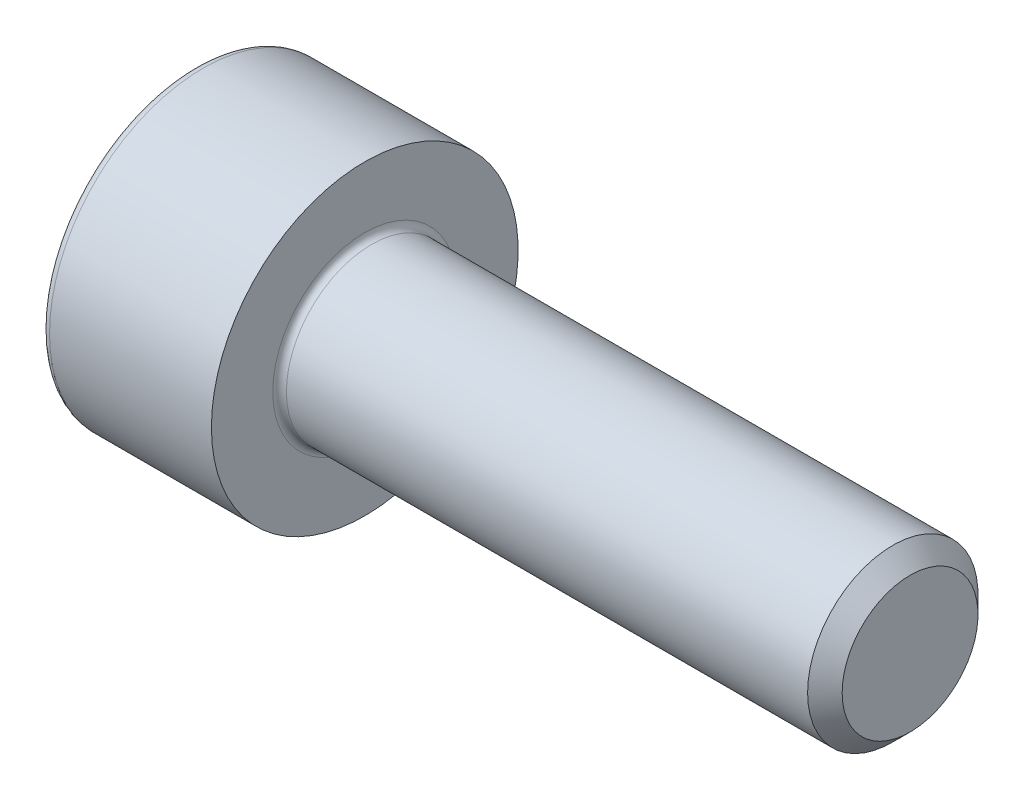
ISO-10303-21;
HEADER;
FILE_DESCRIPTION(('STEP AP214'),'2;1');
FILE_NAME('part.step','',(''),(''),'','','');
FILE_SCHEMA(('AUTOMOTIVE_DESIGN { 1 0 10303 214 1 1 1 1 }'));
ENDSEC;
DATA;
#1=APPLICATION_CONTEXT('core data for automotive mechanical design processes');
#2=APPLICATION_PROTOCOL_DEFINITION('international standard','automotive_design',2000,#1);
#3=PRODUCT_CONTEXT('',#1,'mechanical');
#4=PRODUCT('Part','Part','',(#3));
#5=PRODUCT_RELATED_PRODUCT_CATEGORY('part','',(#4));
#6=PRODUCT_DEFINITION_FORMATION('','',#4);
#7=PRODUCT_DEFINITION_CONTEXT('part definition',#1,'design');
#8=PRODUCT_DEFINITION('design','',#6,#7);
#9=PRODUCT_DEFINITION_SHAPE('','',#8);
#10=(LENGTH_UNIT() NAMED_UNIT(*) SI_UNIT(.MILLI.,.METRE.));
#11=(NAMED_UNIT(*) PLANE_ANGLE_UNIT() SI_UNIT($,.RADIAN.));
#12=(NAMED_UNIT(*) SI_UNIT($,.STERADIAN.) SOLID_ANGLE_UNIT());
#13=UNCERTAINTY_MEASURE_WITH_UNIT(LENGTH_MEASURE(1.E-05),#10,'distance_accuracy_value','');
#14=(GEOMETRIC_REPRESENTATION_CONTEXT(3) GLOBAL_UNCERTAINTY_ASSIGNED_CONTEXT((#13)) GLOBAL_UNIT_ASSIGNED_CONTEXT((#10,
#11,#12)) REPRESENTATION_CONTEXT('',''));
#15=CARTESIAN_POINT('',(0.,0.,0.));
#16=DIRECTION('',(0.,0.,1.));
#17=DIRECTION('',(1.,0.,0.));
#18=AXIS2_PLACEMENT_3D('',#15,#16,#17);
#19=CARTESIAN_POINT('',(0.,0.,0.));
#20=DIRECTION('',(-1.,0.,0.));
#21=DIRECTION('',(0.,0.,1.));
#22=AXIS2_PLACEMENT_3D('',#19,#20,#21);
#23=PLANE('',#22);
#24=DIRECTION('',(0.,-0.499999999999999,0.866025403784439));
#25=VECTOR('',#24,1.);
#26=CARTESIAN_POINT('',(0.,1.18068130049278,0.));
#27=LINE('',#26,#25);
#28=CARTESIAN_POINT('',(0.,1.18068130049278,0.));
#29=VERTEX_POINT('',#28);
#30=CARTESIAN_POINT('',(0.,0.59034065024639,1.0225));
#31=VERTEX_POINT('',#30);
#32=EDGE_CURVE('E261',#29,#31,#27,.T.);
#33=ORIENTED_EDGE('',*,*,#32,.T.);
#34=DIRECTION('',(0.,1.,0.));
#35=VECTOR('',#34,1.);
#36=CARTESIAN_POINT('',(0.,-0.590340650246394,1.0225));
#37=LINE('',#36,#35);
#38=CARTESIAN_POINT('',(0.,-0.590340650246394,1.0225));
#39=VERTEX_POINT('',#38);
#40=EDGE_CURVE('E133',#39,#31,#37,.T.);
#41=ORIENTED_EDGE('',*,*,#40,.F.);
#42=DIRECTION('',(0.,-0.500000000000001,-0.866025403784438));
#43=VECTOR('',#42,1.);
#44=CARTESIAN_POINT('',(0.,-0.590340650246394,1.0225));
#45=LINE('',#44,#43);
#46=CARTESIAN_POINT('',(0.,-1.18068130049279,0.));
#47=VERTEX_POINT('',#46);
#48=EDGE_CURVE('E264',#39,#47,#45,.T.);
#49=ORIENTED_EDGE('',*,*,#48,.T.);
#50=DIRECTION('',(0.,0.499999999999999,-0.86602540378444));
#51=VECTOR('',#50,1.);
#52=CARTESIAN_POINT('',(0.,-1.18068130049279,0.));
#53=LINE('',#52,#51);
#54=CARTESIAN_POINT('',(0.,-0.590340650246397,-1.0225));
#55=VERTEX_POINT('',#54);
#56=EDGE_CURVE('E267',#47,#55,#53,.T.);
#57=ORIENTED_EDGE('',*,*,#56,.T.);
#58=DIRECTION('',(0.,-1.,0.));
#59=VECTOR('',#58,1.);
#60=CARTESIAN_POINT('',(0.,0.590340650246388,-1.0225));
#61=LINE('',#60,#59);
#62=CARTESIAN_POINT('',(0.,0.590340650246388,-1.0225));
#63=VERTEX_POINT('',#62);
#64=EDGE_CURVE('E270',#63,#55,#61,.T.);
#65=ORIENTED_EDGE('',*,*,#64,.F.);
#66=DIRECTION('',(0.,-0.500000000000001,-0.866025403784438));
#67=VECTOR('',#66,1.);
#68=CARTESIAN_POINT('',(0.,1.18068130049278,0.));
#69=LINE('',#68,#67);
#70=EDGE_CURVE('E128',#29,#63,#69,.T.);
#71=ORIENTED_EDGE('',*,*,#70,.F.);
#72=EDGE_LOOP('',(#33,#41,#49,#57,#65,#71));
#73=FACE_BOUND('',#72,.T.);
#74=CARTESIAN_POINT('',(0.,0.,0.));
#75=DIRECTION('',(-1.,0.,0.));
#76=DIRECTION('',(0.,0.,1.));
#77=AXIS2_PLACEMENT_3D('',#74,#75,#76);
#78=CIRCLE('',#77,2.125);
#79=CARTESIAN_POINT('',(0.,0.,2.125));
#80=VERTEX_POINT('',#79);
#81=EDGE_CURVE('E45',#80,#80,#78,.T.);
#82=ORIENTED_EDGE('',*,*,#81,.T.);
#83=EDGE_LOOP('',(#82));
#84=FACE_BOUND('',#83,.T.);
#85=ADVANCED_FACE('F37',(#73,#84),#23,.T.);
#86=CARTESIAN_POINT('',(-31.75,0.,0.));
#87=DIRECTION('',(-1.,0.,0.));
#88=DIRECTION('',(0.,0.,1.));
#89=AXIS2_PLACEMENT_3D('',#86,#87,#88);
#90=CYLINDRICAL_SURFACE('',#89,2.25);
#91=CARTESIAN_POINT('',(0.125,0.,0.));
#92=DIRECTION('',(-1.,0.,0.));
#93=DIRECTION('',(0.,0.,1.));
#94=AXIS2_PLACEMENT_3D('',#91,#92,#93);
#95=CIRCLE('',#94,2.25);
#96=CARTESIAN_POINT('',(0.125,0.,2.25));
#97=VERTEX_POINT('',#96);
#98=EDGE_CURVE('E11',#97,#97,#95,.F.);
#99=ORIENTED_EDGE('',*,*,#98,.T.);
#100=EDGE_LOOP('',(#99));
#101=FACE_BOUND('',#100,.T.);
#102=CARTESIAN_POINT('',(2.5,0.,0.));
#103=DIRECTION('',(-1.,0.,0.));
#104=DIRECTION('',(0.,0.,1.));
#105=AXIS2_PLACEMENT_3D('',#102,#103,#104);
#106=CIRCLE('',#105,2.25);
#107=CARTESIAN_POINT('',(2.5,0.,2.25));
#108=VERTEX_POINT('',#107);
#109=EDGE_CURVE('E151',#108,#108,#106,.T.);
#110=ORIENTED_EDGE('',*,*,#109,.T.);
#111=EDGE_LOOP('',(#110));
#112=FACE_BOUND('',#111,.T.);
#113=ADVANCED_FACE('F175',(#101,#112),#90,.T.);
#114=CARTESIAN_POINT('',(2.5,2.25,0.));
#115=DIRECTION('',(1.,0.,0.));
#116=DIRECTION('',(0.,0.,-1.));
#117=AXIS2_PLACEMENT_3D('',#114,#115,#116);
#118=PLANE('',#117);
#119=CARTESIAN_POINT('',(2.5,0.,0.));
#120=DIRECTION('',(1.,0.,0.));
#121=DIRECTION('',(0.,0.,-1.));
#122=AXIS2_PLACEMENT_3D('',#119,#120,#121);
#123=CIRCLE('',#122,1.35);
#124=CARTESIAN_POINT('',(2.5,0.,-1.35));
#125=VERTEX_POINT('',#124);
#126=EDGE_CURVE('E154',#125,#125,#123,.F.);
#127=ORIENTED_EDGE('',*,*,#126,.T.);
#128=EDGE_LOOP('',(#127));
#129=FACE_BOUND('',#128,.T.);
#130=ORIENTED_EDGE('',*,*,#109,.F.);
#131=EDGE_LOOP('',(#130));
#132=FACE_BOUND('',#131,.T.);
#133=ADVANCED_FACE('F181',(#129,#132),#118,.T.);
#134=CARTESIAN_POINT('',(-31.75,0.,0.));
#135=DIRECTION('',(-1.,0.,0.));
#136=DIRECTION('',(0.,0.,1.));
#137=AXIS2_PLACEMENT_3D('',#134,#135,#136);
#138=CYLINDRICAL_SURFACE('',#137,1.25);
#139=CARTESIAN_POINT('',(2.6,0.,0.));
#140=DIRECTION('',(1.,0.,0.));
#141=DIRECTION('',(0.,0.,-1.));
#142=AXIS2_PLACEMENT_3D('',#139,#140,#141);
#143=CIRCLE('',#142,1.25);
#144=CARTESIAN_POINT('',(2.6,0.,-1.25));
#145=VERTEX_POINT('',#144);
#146=EDGE_CURVE('E157',#145,#145,#143,.T.);
#147=ORIENTED_EDGE('',*,*,#146,.T.);
#148=EDGE_LOOP('',(#147));
#149=FACE_BOUND('',#148,.T.);
#150=CARTESIAN_POINT('',(10.2465,0.,0.));
#151=DIRECTION('',(-1.,0.,0.));
#152=DIRECTION('',(0.,0.,1.));
#153=AXIS2_PLACEMENT_3D('',#150,#151,#152);
#154=CIRCLE('',#153,1.24999999999999);
#155=CARTESIAN_POINT('',(10.2465,0.,1.24999999999999));
#156=VERTEX_POINT('',#155);
#157=EDGE_CURVE('E148',#156,#156,#154,.T.);
#158=ORIENTED_EDGE('',*,*,#157,.T.);
#159=EDGE_LOOP('',(#158));
#160=FACE_BOUND('',#159,.T.);
#161=ADVANCED_FACE('F187',(#149,#160),#138,.T.);
#162=CARTESIAN_POINT('',(10.5,0.,0.));
#163=DIRECTION('',(-1.,0.,0.));
#164=DIRECTION('',(0.,0.,1.));
#165=AXIS2_PLACEMENT_3D('',#162,#163,#164);
#166=CONICAL_SURFACE('',#165,0.9965,0.785398163397419);
#167=ORIENTED_EDGE('',*,*,#157,.F.);
#168=EDGE_LOOP('',(#167));
#169=FACE_BOUND('',#168,.T.);
#170=CARTESIAN_POINT('',(10.5,0.,0.));
#171=DIRECTION('',(-1.,0.,0.));
#172=DIRECTION('',(0.,0.,1.));
#173=AXIS2_PLACEMENT_3D('',#170,#171,#172);
#174=CIRCLE('',#173,0.9965);
#175=CARTESIAN_POINT('',(10.5,0.,0.9965));
#176=VERTEX_POINT('',#175);
#177=EDGE_CURVE('E144',#176,#176,#174,.T.);
#178=ORIENTED_EDGE('',*,*,#177,.T.);
#179=EDGE_LOOP('',(#178));
#180=FACE_BOUND('',#179,.T.);
#181=ADVANCED_FACE('F191',(#169,#180),#166,.T.);
#182=CARTESIAN_POINT('',(10.5,0.9965,0.));
#183=DIRECTION('',(1.,0.,0.));
#184=DIRECTION('',(0.,0.,-1.));
#185=AXIS2_PLACEMENT_3D('',#182,#183,#184);
#186=PLANE('',#185);
#187=ORIENTED_EDGE('',*,*,#177,.F.);
#188=EDGE_LOOP('',(#187));
#189=FACE_BOUND('',#188,.T.);
#190=ADVANCED_FACE('F171',(#189),#186,.T.);
#191=CARTESIAN_POINT('',(2.6,0.,0.));
#192=DIRECTION('',(1.,0.,0.));
#193=DIRECTION('',(0.,0.,-1.));
#194=AXIS2_PLACEMENT_3D('',#191,#192,#193);
#195=TOROIDAL_SURFACE('',#194,1.35,0.1);
#196=ORIENTED_EDGE('',*,*,#146,.F.);
#197=EDGE_LOOP('',(#196));
#198=FACE_BOUND('',#197,.T.);
#199=ORIENTED_EDGE('',*,*,#126,.F.);
#200=EDGE_LOOP('',(#199));
#201=FACE_BOUND('',#200,.T.);
#202=ADVANCED_FACE('F164',(#198,#201),#195,.F.);
#203=CARTESIAN_POINT('',(0.125,0.,0.));
#204=DIRECTION('',(-1.,0.,0.));
#205=DIRECTION('',(0.,0.,1.));
#206=AXIS2_PLACEMENT_3D('',#203,#204,#205);
#207=TOROIDAL_SURFACE('',#206,2.125,0.125);
#208=ORIENTED_EDGE('',*,*,#98,.F.);
#209=EDGE_LOOP('',(#208));
#210=FACE_BOUND('',#209,.T.);
#211=ORIENTED_EDGE('',*,*,#81,.F.);
#212=EDGE_LOOP('',(#211));
#213=FACE_BOUND('',#212,.T.);
#214=ADVANCED_FACE('F39',(#210,#213),#207,.T.);
#215=CARTESIAN_POINT('',(1.1,1.18068130049278,0.));
#216=DIRECTION('',(0.,-0.866025403784439,-0.5));
#217=DIRECTION('',(0.,0.5,-0.866025403784439));
#218=AXIS2_PLACEMENT_3D('',#215,#216,#217);
#219=PLANE('',#218);
#220=ORIENTED_EDGE('',*,*,#32,.F.);
#221=DIRECTION('',(-1.,0.,0.));
#222=VECTOR('',#221,1.);
#223=CARTESIAN_POINT('',(1.1,1.18068130049278,0.));
#224=LINE('',#223,#222);
#225=CARTESIAN_POINT('',(1.1,1.18068130049278,0.));
#226=VERTEX_POINT('',#225);
#227=EDGE_CURVE('E251',#226,#29,#224,.T.);
#228=ORIENTED_EDGE('',*,*,#227,.F.);
#229=DIRECTION('',(0.,-0.499999999999999,0.866025403784439));
#230=VECTOR('',#229,1.);
#231=CARTESIAN_POINT('',(1.1,1.18068130049278,0.));
#232=LINE('',#231,#230);
#233=CARTESIAN_POINT('',(1.1,0.885510975369585,0.511249999999997));
#234=VERTEX_POINT('',#233);
#235=EDGE_CURVE('E120',#226,#234,#232,.T.);
#236=ORIENTED_EDGE('',*,*,#235,.T.);
#237=CARTESIAN_POINT('',(1.1,0.59034065024639,1.0225));
#238=VERTEX_POINT('',#237);
#239=EDGE_CURVE('E111',#234,#238,#232,.T.);
#240=ORIENTED_EDGE('',*,*,#239,.T.);
#241=DIRECTION('',(-1.,0.,0.));
#242=VECTOR('',#241,1.);
#243=CARTESIAN_POINT('',(1.1,0.59034065024639,1.0225));
#244=LINE('',#243,#242);
#245=EDGE_CURVE('E125',#238,#31,#244,.T.);
#246=ORIENTED_EDGE('',*,*,#245,.T.);
#247=EDGE_LOOP('',(#220,#228,#236,#240,#246));
#248=FACE_BOUND('',#247,.T.);
#249=ADVANCED_FACE('F124',(#248),#219,.T.);
#250=CARTESIAN_POINT('',(1.1,-0.590340650246394,1.0225));
#251=DIRECTION('',(0.,0.,1.));
#252=DIRECTION('',(0.,-1.,0.));
#253=AXIS2_PLACEMENT_3D('',#250,#251,#252);
#254=PLANE('',#253);
#255=ORIENTED_EDGE('',*,*,#40,.T.);
#256=ORIENTED_EDGE('',*,*,#245,.F.);
#257=DIRECTION('',(0.,1.,0.));
#258=VECTOR('',#257,1.);
#259=CARTESIAN_POINT('',(1.1,-0.590340650246394,1.0225));
#260=LINE('',#259,#258);
#261=CARTESIAN_POINT('',(1.1,0.,1.0225));
#262=VERTEX_POINT('',#261);
#263=EDGE_CURVE('E108',#262,#238,#260,.T.);
#264=ORIENTED_EDGE('',*,*,#263,.F.);
#265=CARTESIAN_POINT('',(1.1,-0.590340650246394,1.0225));
#266=VERTEX_POINT('',#265);
#267=EDGE_CURVE('E119',#266,#262,#260,.T.);
#268=ORIENTED_EDGE('',*,*,#267,.F.);
#269=DIRECTION('',(-1.,0.,0.));
#270=VECTOR('',#269,1.);
#271=CARTESIAN_POINT('',(1.1,-0.590340650246394,1.0225));
#272=LINE('',#271,#270);
#273=EDGE_CURVE('E135',#266,#39,#272,.T.);
#274=ORIENTED_EDGE('',*,*,#273,.T.);
#275=EDGE_LOOP('',(#255,#256,#264,#268,#274));
#276=FACE_BOUND('',#275,.T.);
#277=ADVANCED_FACE('F130',(#276),#254,.F.);
#278=CARTESIAN_POINT('',(1.1,-0.590340650246394,1.0225));
#279=DIRECTION('',(0.,0.866025403784438,-0.500000000000001));
#280=DIRECTION('',(0.,0.500000000000001,0.866025403784438));
#281=AXIS2_PLACEMENT_3D('',#278,#279,#280);
#282=PLANE('',#281);
#283=ORIENTED_EDGE('',*,*,#48,.F.);
#284=ORIENTED_EDGE('',*,*,#273,.F.);
#285=DIRECTION('',(0.,-0.500000000000001,-0.866025403784438));
#286=VECTOR('',#285,1.);
#287=CARTESIAN_POINT('',(1.1,-0.590340650246394,1.0225));
#288=LINE('',#287,#286);
#289=CARTESIAN_POINT('',(1.1,-0.885510975369589,0.511250000000002));
#290=VERTEX_POINT('',#289);
#291=EDGE_CURVE('E290',#266,#290,#288,.T.);
#292=ORIENTED_EDGE('',*,*,#291,.T.);
#293=CARTESIAN_POINT('',(1.1,-1.18068130049279,0.));
#294=VERTEX_POINT('',#293);
#295=EDGE_CURVE('E279',#290,#294,#288,.T.);
#296=ORIENTED_EDGE('',*,*,#295,.T.);
#297=DIRECTION('',(-1.,0.,0.));
#298=VECTOR('',#297,1.);
#299=CARTESIAN_POINT('',(1.1,-1.18068130049279,0.));
#300=LINE('',#299,#298);
#301=EDGE_CURVE('E140',#294,#47,#300,.T.);
#302=ORIENTED_EDGE('',*,*,#301,.T.);
#303=EDGE_LOOP('',(#283,#284,#292,#296,#302));
#304=FACE_BOUND('',#303,.T.);
#305=ADVANCED_FACE('F205',(#304),#282,.T.);
#306=CARTESIAN_POINT('',(1.1,-1.18068130049279,0.));
#307=DIRECTION('',(0.,0.86602540378444,0.499999999999998));
#308=DIRECTION('',(0.,-0.499999999999998,0.86602540378444));
#309=AXIS2_PLACEMENT_3D('',#306,#307,#308);
#310=PLANE('',#309);
#311=ORIENTED_EDGE('',*,*,#56,.F.);
#312=ORIENTED_EDGE('',*,*,#301,.F.);
#313=DIRECTION('',(0.,0.499999999999999,-0.86602540378444));
#314=VECTOR('',#313,1.);
#315=CARTESIAN_POINT('',(1.1,-1.18068130049279,0.));
#316=LINE('',#315,#314);
#317=CARTESIAN_POINT('',(1.1,-0.885510975369594,-0.511250000000001));
#318=VERTEX_POINT('',#317);
#319=EDGE_CURVE('E257',#294,#318,#316,.T.);
#320=ORIENTED_EDGE('',*,*,#319,.T.);
#321=CARTESIAN_POINT('',(1.1,-0.590340650246397,-1.0225));
#322=VERTEX_POINT('',#321);
#323=EDGE_CURVE('E289',#318,#322,#316,.T.);
#324=ORIENTED_EDGE('',*,*,#323,.T.);
#325=DIRECTION('',(-1.,0.,0.));
#326=VECTOR('',#325,1.);
#327=CARTESIAN_POINT('',(1.1,-0.590340650246397,-1.0225));
#328=LINE('',#327,#326);
#329=EDGE_CURVE('E250',#322,#55,#328,.T.);
#330=ORIENTED_EDGE('',*,*,#329,.T.);
#331=EDGE_LOOP('',(#311,#312,#320,#324,#330));
#332=FACE_BOUND('',#331,.T.);
#333=ADVANCED_FACE('F208',(#332),#310,.T.);
#334=CARTESIAN_POINT('',(1.1,0.590340650246388,-1.0225));
#335=DIRECTION('',(0.,0.,-1.));
#336=DIRECTION('',(0.,1.,0.));
#337=AXIS2_PLACEMENT_3D('',#334,#335,#336);
#338=PLANE('',#337);
#339=ORIENTED_EDGE('',*,*,#64,.T.);
#340=ORIENTED_EDGE('',*,*,#329,.F.);
#341=DIRECTION('',(0.,-1.,0.));
#342=VECTOR('',#341,1.);
#343=CARTESIAN_POINT('',(1.1,0.590340650246388,-1.0225));
#344=LINE('',#343,#342);
#345=CARTESIAN_POINT('',(1.1,0.,-1.0225));
#346=VERTEX_POINT('',#345);
#347=EDGE_CURVE('E254',#346,#322,#344,.T.);
#348=ORIENTED_EDGE('',*,*,#347,.F.);
#349=CARTESIAN_POINT('',(1.1,0.590340650246388,-1.0225));
#350=VERTEX_POINT('',#349);
#351=EDGE_CURVE('E52',#350,#346,#344,.T.);
#352=ORIENTED_EDGE('',*,*,#351,.F.);
#353=DIRECTION('',(-1.,0.,0.));
#354=VECTOR('',#353,1.);
#355=CARTESIAN_POINT('',(1.1,0.590340650246388,-1.0225));
#356=LINE('',#355,#354);
#357=EDGE_CURVE('E247',#350,#63,#356,.T.);
#358=ORIENTED_EDGE('',*,*,#357,.T.);
#359=EDGE_LOOP('',(#339,#340,#348,#352,#358));
#360=FACE_BOUND('',#359,.T.);
#361=ADVANCED_FACE('F212',(#360),#338,.F.);
#362=CARTESIAN_POINT('',(1.1,1.18068130049278,0.));
#363=DIRECTION('',(0.,0.866025403784438,-0.500000000000001));
#364=DIRECTION('',(0.,0.500000000000001,0.866025403784438));
#365=AXIS2_PLACEMENT_3D('',#362,#363,#364);
#366=PLANE('',#365);
#367=ORIENTED_EDGE('',*,*,#70,.T.);
#368=ORIENTED_EDGE('',*,*,#357,.F.);
#369=DIRECTION('',(0.,-0.500000000000001,-0.866025403784438));
#370=VECTOR('',#369,1.);
#371=CARTESIAN_POINT('',(1.1,1.18068130049278,0.));
#372=LINE('',#371,#370);
#373=CARTESIAN_POINT('',(1.1,0.885510975369587,-0.511250000000001));
#374=VERTEX_POINT('',#373);
#375=EDGE_CURVE('E237',#374,#350,#372,.T.);
#376=ORIENTED_EDGE('',*,*,#375,.F.);
#377=EDGE_CURVE('E243',#226,#374,#372,.T.);
#378=ORIENTED_EDGE('',*,*,#377,.F.);
#379=ORIENTED_EDGE('',*,*,#227,.T.);
#380=EDGE_LOOP('',(#367,#368,#376,#378,#379));
#381=FACE_BOUND('',#380,.T.);
#382=ADVANCED_FACE('F216',(#381),#366,.F.);
#383=CARTESIAN_POINT('',(1.1,0.,2.045));
#384=DIRECTION('',(1.,0.,0.));
#385=DIRECTION('',(0.,0.,-1.));
#386=AXIS2_PLACEMENT_3D('',#383,#384,#385);
#387=PLANE('',#386);
#388=ORIENTED_EDGE('',*,*,#347,.T.);
#389=ORIENTED_EDGE('',*,*,#323,.F.);
#390=CARTESIAN_POINT('',(1.1,0.,0.));
#391=DIRECTION('',(-1.,0.,0.));
#392=DIRECTION('',(0.,0.,1.));
#393=AXIS2_PLACEMENT_3D('',#390,#391,#392);
#394=CIRCLE('',#393,1.0225);
#395=EDGE_CURVE('E285',#346,#318,#394,.T.);
#396=ORIENTED_EDGE('',*,*,#395,.F.);
#397=EDGE_LOOP('',(#388,#389,#396));
#398=FACE_BOUND('',#397,.T.);
#399=ADVANCED_FACE('F220',(#398),#387,.F.);
#400=ORIENTED_EDGE('',*,*,#319,.F.);
#401=ORIENTED_EDGE('',*,*,#295,.F.);
#402=EDGE_CURVE('E138',#318,#290,#394,.T.);
#403=ORIENTED_EDGE('',*,*,#402,.F.);
#404=EDGE_LOOP('',(#400,#401,#403));
#405=FACE_BOUND('',#404,.T.);
#406=ADVANCED_FACE('F223',(#405),#387,.F.);
#407=ORIENTED_EDGE('',*,*,#291,.F.);
#408=ORIENTED_EDGE('',*,*,#267,.T.);
#409=EDGE_CURVE('E134',#290,#262,#394,.T.);
#410=ORIENTED_EDGE('',*,*,#409,.F.);
#411=EDGE_LOOP('',(#407,#408,#410));
#412=FACE_BOUND('',#411,.T.);
#413=ADVANCED_FACE('F228',(#412),#387,.F.);
#414=ORIENTED_EDGE('',*,*,#263,.T.);
#415=ORIENTED_EDGE('',*,*,#239,.F.);
#416=EDGE_CURVE('E114',#262,#234,#394,.T.);
#417=ORIENTED_EDGE('',*,*,#416,.F.);
#418=EDGE_LOOP('',(#414,#415,#417));
#419=FACE_BOUND('',#418,.T.);
#420=ADVANCED_FACE('F110',(#419),#387,.F.);
#421=ORIENTED_EDGE('',*,*,#235,.F.);
#422=ORIENTED_EDGE('',*,*,#377,.T.);
#423=EDGE_CURVE('E145',#234,#374,#394,.T.);
#424=ORIENTED_EDGE('',*,*,#423,.F.);
#425=EDGE_LOOP('',(#421,#422,#424));
#426=FACE_BOUND('',#425,.T.);
#427=ADVANCED_FACE('F231',(#426),#387,.F.);
#428=ORIENTED_EDGE('',*,*,#375,.T.);
#429=ORIENTED_EDGE('',*,*,#351,.T.);
#430=EDGE_CURVE('E240',#374,#346,#394,.T.);
#431=ORIENTED_EDGE('',*,*,#430,.F.);
#432=EDGE_LOOP('',(#428,#429,#431));
#433=FACE_BOUND('',#432,.T.);
#434=ADVANCED_FACE('F201',(#433),#387,.F.);
#435=CARTESIAN_POINT('',(1.1,0.,0.));
#436=DIRECTION('',(-1.,0.,0.));
#437=DIRECTION('',(0.,0.,1.));
#438=AXIS2_PLACEMENT_3D('',#435,#436,#437);
#439=CONICAL_SURFACE('',#438,1.0225,1.04719755119659);
#440=CARTESIAN_POINT('',(1.6903406502464,0.,0.));
#441=VERTEX_POINT('',#440);
#442=VERTEX_LOOP('',#441);
#443=FACE_BOUND('',#442,.T.);
#444=ORIENTED_EDGE('',*,*,#416,.T.);
#445=ORIENTED_EDGE('',*,*,#423,.T.);
#446=ORIENTED_EDGE('',*,*,#430,.T.);
#447=ORIENTED_EDGE('',*,*,#395,.T.);
#448=ORIENTED_EDGE('',*,*,#402,.T.);
#449=ORIENTED_EDGE('',*,*,#409,.T.);
#450=EDGE_LOOP('',(#444,#445,#446,#447,#448,#449));
#451=FACE_BOUND('',#450,.T.);
#452=ADVANCED_FACE('F199',(#443,#451),#439,.F.);
#453=CLOSED_SHELL('',(#85,#113,#133,#161,#181,#190,#202,#214,#249,#277,#305,#333,#361,#382,#399,
#406,#413,#420,#427,#434,#452));
#454=MANIFOLD_SOLID_BREP('B2',#453);
#455=ADVANCED_BREP_SHAPE_REPRESENTATION('',(#18,#454),#14);
#456=SHAPE_DEFINITION_REPRESENTATION(#9,#455);
ENDSEC;
END-ISO-10303-21;
